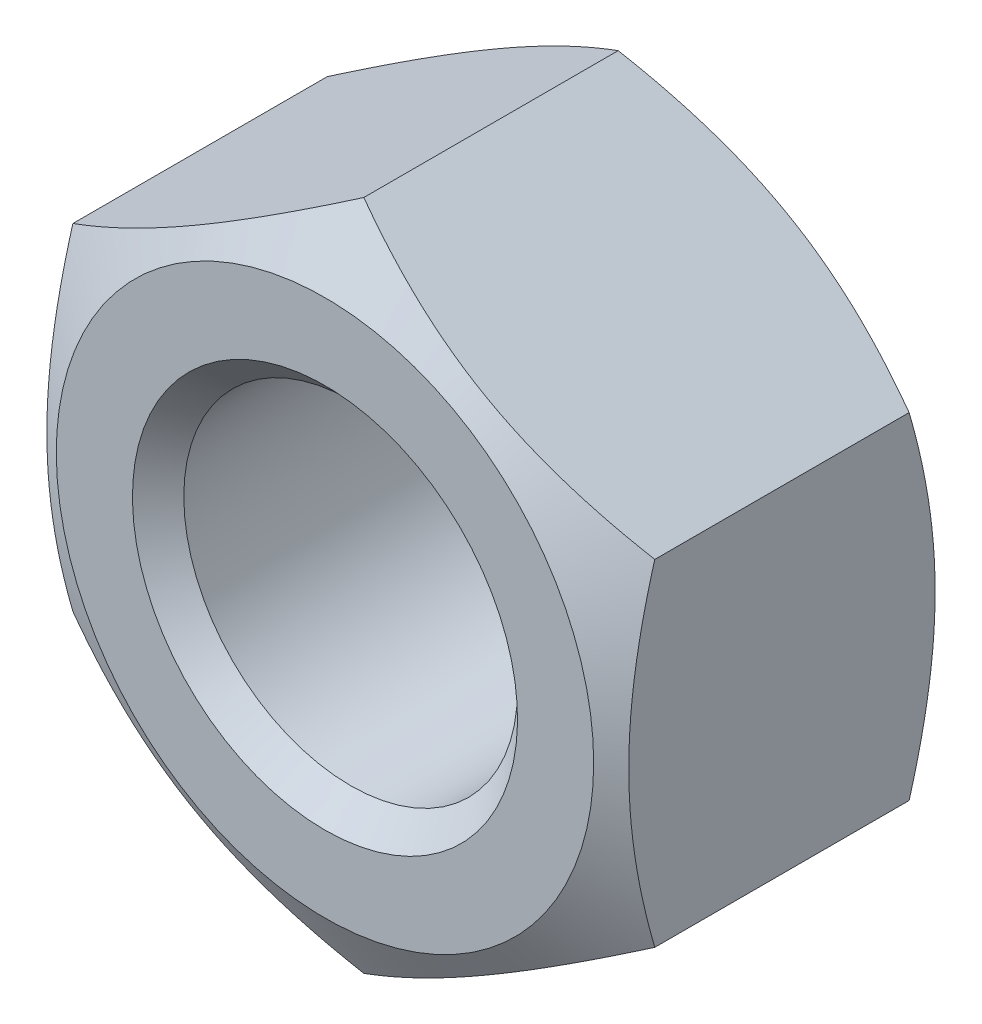
ISO-10303-21;
HEADER;
FILE_DESCRIPTION(('STEP AP214'),'2;1');
FILE_NAME('part.step','',(''),(''),'','','');
FILE_SCHEMA(('AUTOMOTIVE_DESIGN { 1 0 10303 214 1 1 1 1 }'));
ENDSEC;
DATA;
#1=APPLICATION_CONTEXT('core data for automotive mechanical design processes');
#2=APPLICATION_PROTOCOL_DEFINITION('international standard','automotive_design',2000,#1);
#3=PRODUCT_CONTEXT('',#1,'mechanical');
#4=PRODUCT('Part','Part','',(#3));
#5=PRODUCT_RELATED_PRODUCT_CATEGORY('part','',(#4));
#6=PRODUCT_DEFINITION_FORMATION('','',#4);
#7=PRODUCT_DEFINITION_CONTEXT('part definition',#1,'design');
#8=PRODUCT_DEFINITION('design','',#6,#7);
#9=PRODUCT_DEFINITION_SHAPE('','',#8);
#10=(LENGTH_UNIT() NAMED_UNIT(*) SI_UNIT(.MILLI.,.METRE.));
#11=(NAMED_UNIT(*) PLANE_ANGLE_UNIT() SI_UNIT($,.RADIAN.));
#12=(NAMED_UNIT(*) SI_UNIT($,.STERADIAN.) SOLID_ANGLE_UNIT());
#13=UNCERTAINTY_MEASURE_WITH_UNIT(LENGTH_MEASURE(1.E-05),#10,'distance_accuracy_value','');
#14=(GEOMETRIC_REPRESENTATION_CONTEXT(3) GLOBAL_UNCERTAINTY_ASSIGNED_CONTEXT((#13)) GLOBAL_UNIT_ASSIGNED_CONTEXT((#10,
#11,#12)) REPRESENTATION_CONTEXT('',''));
#15=CARTESIAN_POINT('',(0.,0.,0.));
#16=DIRECTION('',(0.,0.,1.));
#17=DIRECTION('',(1.,0.,0.));
#18=AXIS2_PLACEMENT_3D('',#15,#16,#17);
#19=CARTESIAN_POINT('',(0.,0.,0.));
#20=DIRECTION('',(0.,0.,1.));
#21=DIRECTION('',(1.,0.,0.));
#22=AXIS2_PLACEMENT_3D('',#19,#20,#21);
#23=PLANE('',#22);
#24=CARTESIAN_POINT('',(0.,0.,0.));
#25=DIRECTION('',(0.,0.,1.));
#26=DIRECTION('',(0.,-1.,0.));
#27=AXIS2_PLACEMENT_3D('',#24,#25,#26);
#28=CIRCLE('',#27,11.25);
#29=CARTESIAN_POINT('',(0.,-11.25,0.));
#30=VERTEX_POINT('',#29);
#31=EDGE_CURVE('E262',#30,#30,#28,.T.);
#32=ORIENTED_EDGE('',*,*,#31,.F.);
#33=EDGE_LOOP('',(#32));
#34=FACE_BOUND('',#33,.T.);
#35=CARTESIAN_POINT('',(0.,0.,0.));
#36=DIRECTION('',(0.,0.,1.));
#37=DIRECTION('',(1.,0.,0.));
#38=AXIS2_PLACEMENT_3D('',#35,#36,#37);
#39=CIRCLE('',#38,15.7);
#40=CARTESIAN_POINT('',(15.7,0.,0.));
#41=VERTEX_POINT('',#40);
#42=EDGE_CURVE('E221',#41,#41,#39,.T.);
#43=ORIENTED_EDGE('',*,*,#42,.T.);
#44=EDGE_LOOP('',(#43));
#45=FACE_BOUND('',#44,.T.);
#46=ADVANCED_FACE('F34',(#34,#45),#23,.T.);
#47=CARTESIAN_POINT('',(0.,0.,0.));
#48=DIRECTION('',(0.,0.,-1.));
#49=DIRECTION('',(-1.,0.,0.));
#50=AXIS2_PLACEMENT_3D('',#47,#48,#49);
#51=CONICAL_SURFACE('',#50,15.7,1.0471975511966);
#52=CARTESIAN_POINT('',(-17.0002,9.81483910616981,-2.26900077431108));
#53=CARTESIAN_POINT('',(-16.6265469064567,10.0305678203106,-2.14445819023212));
#54=CARTESIAN_POINT('',(-16.251436365233,10.2471379922619,-2.02556713985945));
#55=CARTESIAN_POINT('',(-15.4982073403609,10.6820149725333,-1.80065903466373));
#56=CARTESIAN_POINT('',(-15.1200879107272,10.9003223270181,-1.69464621406476));
#57=CARTESIAN_POINT('',(-14.3601103187305,11.3390955943355,-1.49691959430863));
#58=CARTESIAN_POINT('',(-13.9782455058022,11.5595653468737,-1.40523962826047));
#59=CARTESIAN_POINT('',(-13.2118624748498,12.0020367960964,-1.23814738869012));
#60=CARTESIAN_POINT('',(-12.8273444100892,12.2240384042942,-1.16273418351413));
#61=CARTESIAN_POINT('',(-12.0655075393886,12.6638851266718,-1.03138301007862));
#62=CARTESIAN_POINT('',(-11.6882452921721,12.8816975866573,-0.975010293167007));
#63=CARTESIAN_POINT('',(-10.9319921229911,13.3183205574595,-0.880485850052318));
#64=CARTESIAN_POINT('',(-10.5530011678939,13.5371310874053,-0.842334474574963));
#65=CARTESIAN_POINT('',(-9.79438261780434,13.9751197115118,-0.785216014403568));
#66=CARTESIAN_POINT('',(-9.41475631882947,14.1942970574164,-0.76622613300532));
#67=CARTESIAN_POINT('',(-8.65515330704035,14.6328540607501,-0.747839050498202));
#68=CARTESIAN_POINT('',(-8.27517660541659,14.8522337117183,-0.748441243980961));
#69=CARTESIAN_POINT('',(-7.56480067427073,15.2623694467912,-0.767870053870435));
#70=CARTESIAN_POINT('',(-7.23435083193736,15.4531547522161,-0.784327500506852));
#71=CARTESIAN_POINT('',(-6.57423939634649,15.8342702672496,-0.831747883297576));
#72=CARTESIAN_POINT('',(-6.2445777918682,16.0246004833366,-0.862710611714524));
#73=CARTESIAN_POINT('',(-5.58616773221974,16.4047337085118,-0.938604295800273));
#74=CARTESIAN_POINT('',(-5.25742037514752,16.5945360836128,-0.983547882986054));
#75=CARTESIAN_POINT('',(-4.60149064349035,16.9732372907546,-1.08661020340748));
#76=CARTESIAN_POINT('',(-4.27430826227985,17.1621361266206,-1.14472888081401));
#77=CARTESIAN_POINT('',(-3.281103910772,17.7355629263239,-1.34032568866998));
#78=CARTESIAN_POINT('',(-2.61795816688453,18.1184303000693,-1.4973073879878));
#79=CARTESIAN_POINT('',(-1.30155488695446,18.878456088099,-1.85359145296698));
#80=CARTESIAN_POINT('',(-0.648280497058976,19.2556242329599,-2.05281014623164));
#81=CARTESIAN_POINT('',(0.000200000000001784,19.6300246225011,-2.26900077431108));
#82=B_SPLINE_CURVE_WITH_KNOTS('',3,(#52,#53,#54,#55,#56,#57,#58,#59,#60,#61,#62,#63,#64,#65,#66,
#67,#68,#69,#70,#71,#72,#73,#74,#75,#76,#77,#78,#79,#80,#81),.UNSPECIFIED.,.F.,.F.,(4,2,2,2,2,2,
2,2,2,2,2,2,2,2,4),(0.,1.34725361023886,2.6949489909653,4.04577911356302,5.39653184888179,
6.71394507676439,8.03138366129191,9.34725301563479,10.6630817087628,11.808581597515,
12.9540650814946,14.1005865149997,15.2471030902392,17.590639246696,19.929575477219),.UNSPECIFIED.);
#83=CARTESIAN_POINT('',(-17.,9.81495457622365,-2.26893410705618));
#84=VERTEX_POINT('',#83);
#85=CARTESIAN_POINT('',(0.,19.6299091524473,-2.26893410705618));
#86=VERTEX_POINT('',#85);
#87=EDGE_CURVE('E216',#84,#86,#82,.T.);
#88=ORIENTED_EDGE('',*,*,#87,.F.);
#89=CARTESIAN_POINT('',(-17.,-25.9267472467528,-8.83528627186308));
#90=CARTESIAN_POINT('',(-17.,-25.5539648090977,-8.65530488119288));
#91=CARTESIAN_POINT('',(-17.,-25.1807288184547,-8.47626336943934));
#92=CARTESIAN_POINT('',(-17.,-24.4332538627016,-8.12027608125413));
#93=CARTESIAN_POINT('',(-17.,-24.0590148864408,-7.94333032824134));
#94=CARTESIAN_POINT('',(-17.,-22.9345384288083,-7.41590864060599));
#95=CARTESIAN_POINT('',(-17.,-22.1826644417827,-7.06890784699101));
#96=CARTESIAN_POINT('',(-17.,-20.6693295294818,-6.38442672467381));
#97=CARTESIAN_POINT('',(-17.,-19.9078382964153,-6.04701323457675));
#98=CARTESIAN_POINT('',(-17.,-18.3785592608469,-5.38682372702414));
#99=CARTESIAN_POINT('',(-17.,-17.6107717926793,-5.06404693821717));
#100=CARTESIAN_POINT('',(-17.,-16.0586340457663,-4.43340326623387));
#101=CARTESIAN_POINT('',(-17.,-15.274195004503,-4.12575369084784));
#102=CARTESIAN_POINT('',(-17.,-13.696022043621,-3.53480920182964));
#103=CARTESIAN_POINT('',(-17.,-12.9022870972841,-3.25151700781198));
#104=CARTESIAN_POINT('',(-17.,-11.3059512165511,-2.71697899718527));
#105=CARTESIAN_POINT('',(-17.,-10.5033735966652,-2.46566413029521));
#106=CARTESIAN_POINT('',(-17.,-8.88673603066168,-2.00329800631384));
#107=CARTESIAN_POINT('',(-17.,-8.07267983149313,-1.79223392262732));
#108=CARTESIAN_POINT('',(-17.,-6.84282468382309,-1.51359777047095));
#109=CARTESIAN_POINT('',(-17.,-6.43130091987701,-1.42702780561636));
#110=CARTESIAN_POINT('',(-17.,-5.60553570443179,-1.26792169073959));
#111=CARTESIAN_POINT('',(-17.,-5.19129431536871,-1.19538521946428));
#112=CARTESIAN_POINT('',(-17.,-4.36037948024351,-1.06563790696937));
#113=CARTESIAN_POINT('',(-17.,-3.94370588240015,-1.00842803287828));
#114=CARTESIAN_POINT('',(-17.,-3.10841242547604,-0.910486373547461));
#115=CARTESIAN_POINT('',(-17.,-2.68979256380067,-0.869754610281469));
#116=CARTESIAN_POINT('',(-17.,-1.85381375994843,-0.805860178374631));
#117=CARTESIAN_POINT('',(-17.,-1.43646307035987,-0.782590240303972));
#118=CARTESIAN_POINT('',(-17.,-0.601153044712188,-0.753740168759731));
#119=CARTESIAN_POINT('',(-17.,-0.183193717826098,-0.748159771384462));
#120=CARTESIAN_POINT('',(-17.,0.652471507108319,-0.754820619047691));
#121=CARTESIAN_POINT('',(-17.,1.070177443126,-0.767057044362938));
#122=CARTESIAN_POINT('',(-17.,1.90470927270493,-0.809050414750458));
#123=CARTESIAN_POINT('',(-17.,2.32153512661024,-0.838808133097964));
#124=CARTESIAN_POINT('',(-17.,3.33484820370525,-0.931831324455307));
#125=CARTESIAN_POINT('',(-17.,3.93052966291356,-1.00404527837153));
#126=CARTESIAN_POINT('',(-17.,5.11715583192569,-1.18021128874136));
#127=CARTESIAN_POINT('',(-17.,5.7080998115513,-1.28416814469026));
#128=CARTESIAN_POINT('',(-17.,7.47489110533387,-1.63843047027764));
#129=CARTESIAN_POINT('',(-17.,8.64238042158542,-1.9308880733226));
#130=CARTESIAN_POINT('',(-17.,10.3885450516742,-2.43429179450095));
#131=CARTESIAN_POINT('',(-17.,10.9763653928662,-2.61530716784065));
#132=CARTESIAN_POINT('',(-17.,12.1463268837286,-2.99516492515156));
#133=CARTESIAN_POINT('',(-17.,12.7284675203987,-3.19400890320246));
#134=CARTESIAN_POINT('',(-17.,13.8841642605752,-3.60530371093944));
#135=CARTESIAN_POINT('',(-17.,14.4577503102576,-3.81767110050551));
#136=CARTESIAN_POINT('',(-17.,15.3145292969767,-4.14530846477523));
#137=CARTESIAN_POINT('',(-17.,15.5994765967891,-4.25601670616324));
#138=CARTESIAN_POINT('',(-17.,16.1682685205824,-4.48021558039378));
#139=CARTESIAN_POINT('',(-17.,16.4521131659655,-4.59370615891639));
#140=CARTESIAN_POINT('',(-17.,16.735444987615,-4.70846199828913));
#141=B_SPLINE_CURVE_WITH_KNOTS('',3,(#89,#90,#91,#92,#93,#94,#95,#96,#97,#98,#99,#100,#101,#102,
#103,#104,#105,#106,#107,#108,#109,#110,#111,#112,#113,#114,#115,#116,#117,#118,#119,#120,#121,
#122,#123,#124,#125,#126,#127,#128,#129,#130,#131,#132,#133,#134,#135,#136,#137,#138,#139,#140),
.UNSPECIFIED.,.F.,.F.,(4,2,2,2,2,2,2,2,2,2,2,2,2,2,2,2,2,2,2,2,2,2,2,2,2,4),(0.,
1.24186727211345,2.48374840829803,4.96792071543007,7.46649146485291,9.96493038667426,
12.4924537659258,15.0202589893835,17.5425096574214,20.0639552194549,21.3253468534078,
22.5867096083098,23.8481519381283,25.1095959500881,26.3632259008802,27.6168371492864,
28.8701093396594,30.1234368454131,31.9225406006737,33.721916513448,37.3276264552829,
39.1726660852152,41.0178708474609,42.8526253217389,43.7697066959693,44.6867701801409),.UNSPECIFIED.);
#142=CARTESIAN_POINT('',(-17.,-9.81495457622364,-2.26893410705618));
#143=VERTEX_POINT('',#142);
#144=EDGE_CURVE('E184',#143,#84,#141,.T.);
#145=ORIENTED_EDGE('',*,*,#144,.F.);
#146=CARTESIAN_POINT('',(0.000199999999992894,-19.6300246225011,-2.26900077431108));
#147=CARTESIAN_POINT('',(-0.373453093543291,-19.4142959083604,-2.14445819023212));
#148=CARTESIAN_POINT('',(-0.748563634767014,-19.197725736409,-2.02556713985945));
#149=CARTESIAN_POINT('',(-1.50179265963909,-18.7628487561377,-1.80065903466373));
#150=CARTESIAN_POINT('',(-1.87991208927283,-18.5445414016528,-1.69464621406476));
#151=CARTESIAN_POINT('',(-2.63988968126951,-18.1057681343354,-1.49691959430863));
#152=CARTESIAN_POINT('',(-3.02175449419786,-17.8852983817972,-1.40523962826047));
#153=CARTESIAN_POINT('',(-3.78813752515018,-17.4428269325745,-1.23814738869012));
#154=CARTESIAN_POINT('',(-4.1726555899108,-17.2208253243767,-1.16273418351413));
#155=CARTESIAN_POINT('',(-4.93449246061139,-16.7809786019991,-1.03138301007862));
#156=CARTESIAN_POINT('',(-5.31175470782787,-16.5631661420136,-0.975010293167006));
#157=CARTESIAN_POINT('',(-6.06800787700895,-16.1265431712114,-0.880485850052319));
#158=CARTESIAN_POINT('',(-6.44699883210612,-15.9077326412656,-0.842334474574963));
#159=CARTESIAN_POINT('',(-7.20561738219567,-15.4697440171592,-0.785216014403568));
#160=CARTESIAN_POINT('',(-7.58524368117054,-15.2505666712546,-0.766226133005319));
#161=CARTESIAN_POINT('',(-8.34484669295967,-14.8120096679209,-0.747839050498201));
#162=CARTESIAN_POINT('',(-8.72482339458342,-14.5926300169526,-0.748441243980961));
#163=CARTESIAN_POINT('',(-9.43519932572928,-14.1824942818797,-0.767870053870435));
#164=CARTESIAN_POINT('',(-9.76564916806265,-13.9917089764549,-0.784327500506851));
#165=CARTESIAN_POINT('',(-10.4257606036535,-13.6105934614213,-0.831747883297576));
#166=CARTESIAN_POINT('',(-10.7554222081318,-13.4202632453343,-0.862710611714525));
#167=CARTESIAN_POINT('',(-11.4138322677803,-13.0401300201591,-0.938604295800274));
#168=CARTESIAN_POINT('',(-11.7425796248525,-12.8503276450581,-0.983547882986055));
#169=CARTESIAN_POINT('',(-12.3985093565097,-12.4716264379163,-1.08661020340748));
#170=CARTESIAN_POINT('',(-12.7256917377202,-12.2827276020504,-1.14472888081401));
#171=CARTESIAN_POINT('',(-13.718896089228,-11.709300802347,-1.34032568866998));
#172=CARTESIAN_POINT('',(-14.3820418331155,-11.3264334286016,-1.4973073879878));
#173=CARTESIAN_POINT('',(-15.6984451130455,-10.5664076405719,-1.85359145296698));
#174=CARTESIAN_POINT('',(-16.351719502941,-10.189239495711,-2.05281014623164));
#175=CARTESIAN_POINT('',(-17.0002,-9.8148391061698,-2.26900077431108));
#176=B_SPLINE_CURVE_WITH_KNOTS('',3,(#146,#147,#148,#149,#150,#151,#152,#153,#154,#155,#156,
#157,#158,#159,#160,#161,#162,#163,#164,#165,#166,#167,#168,#169,#170,#171,#172,#173,#174,#175),
.UNSPECIFIED.,.F.,.F.,(4,2,2,2,2,2,2,2,2,2,2,2,2,2,4),(0.,1.34725361023886,2.6949489909653,
4.04577911356303,5.39653184888179,6.71394507676439,8.0313836612919,9.34725301563479,
10.6630817087628,11.808581597515,12.9540650814946,14.1005865149997,15.2471030902392,
17.590639246696,19.929575477219),.UNSPECIFIED.);
#177=CARTESIAN_POINT('',(0.,-19.6299091524473,-2.26893410705618));
#178=VERTEX_POINT('',#177);
#179=EDGE_CURVE('E176',#178,#143,#176,.T.);
#180=ORIENTED_EDGE('',*,*,#179,.F.);
#181=CARTESIAN_POINT('',(17.0002,-9.81483910616981,-2.26900077431107));
#182=CARTESIAN_POINT('',(16.6265469064567,-10.0305678203106,-2.14445819023211));
#183=CARTESIAN_POINT('',(16.251436365233,-10.2471379922619,-2.02556713985945));
#184=CARTESIAN_POINT('',(15.4982073403609,-10.6820149725333,-1.80065903466373));
#185=CARTESIAN_POINT('',(15.1200879107272,-10.9003223270181,-1.69464621406476));
#186=CARTESIAN_POINT('',(14.3601103187305,-11.3390955943355,-1.49691959430862));
#187=CARTESIAN_POINT('',(13.9782455058021,-11.5595653468737,-1.40523962826047));
#188=CARTESIAN_POINT('',(13.2118624748498,-12.0020367960964,-1.23814738869011));
#189=CARTESIAN_POINT('',(12.8273444100892,-12.2240384042942,-1.16273418351412));
#190=CARTESIAN_POINT('',(12.0655075393886,-12.6638851266718,-1.03138301007861));
#191=CARTESIAN_POINT('',(11.6882452921721,-12.8816975866573,-0.975010293167003));
#192=CARTESIAN_POINT('',(10.931992122991,-13.3183205574595,-0.880485850052316));
#193=CARTESIAN_POINT('',(10.5530011678939,-13.5371310874053,-0.84233447457496));
#194=CARTESIAN_POINT('',(9.79438261780433,-13.9751197115118,-0.785216014403565));
#195=CARTESIAN_POINT('',(9.41475631882946,-14.1942970574164,-0.766226133005318));
#196=CARTESIAN_POINT('',(8.65515330704033,-14.6328540607501,-0.747839050498201));
#197=CARTESIAN_POINT('',(8.27517660541658,-14.8522337117183,-0.748441243980961));
#198=CARTESIAN_POINT('',(7.56480067427072,-15.2623694467912,-0.767870053870435));
#199=CARTESIAN_POINT('',(7.23435083193735,-15.4531547522161,-0.784327500506851));
#200=CARTESIAN_POINT('',(6.57423939634648,-15.8342702672496,-0.831747883297575));
#201=CARTESIAN_POINT('',(6.2445777918682,-16.0246004833366,-0.862710611714522));
#202=CARTESIAN_POINT('',(5.58616773221973,-16.4047337085118,-0.938604295800271));
#203=CARTESIAN_POINT('',(5.25742037514752,-16.5945360836128,-0.983547882986052));
#204=CARTESIAN_POINT('',(4.60149064349034,-16.9732372907546,-1.08661020340748));
#205=CARTESIAN_POINT('',(4.27430826227984,-17.1621361266206,-1.14472888081401));
#206=CARTESIAN_POINT('',(3.28110391077199,-17.7355629263239,-1.34032568866998));
#207=CARTESIAN_POINT('',(2.61795816688453,-18.1184303000693,-1.4973073879878));
#208=CARTESIAN_POINT('',(1.30155488695446,-18.878456088099,-1.85359145296698));
#209=CARTESIAN_POINT('',(0.648280497058971,-19.2556242329599,-2.05281014623164));
#210=CARTESIAN_POINT('',(-0.000200000000007482,-19.6300246225011,-2.26900077431108));
#211=B_SPLINE_CURVE_WITH_KNOTS('',3,(#181,#182,#183,#184,#185,#186,#187,#188,#189,#190,#191,
#192,#193,#194,#195,#196,#197,#198,#199,#200,#201,#202,#203,#204,#205,#206,#207,#208,#209,#210),
.UNSPECIFIED.,.F.,.F.,(4,2,2,2,2,2,2,2,2,2,2,2,2,2,4),(0.,1.34725361023886,2.6949489909653,
4.04577911356302,5.39653184888179,6.71394507676438,8.0313836612919,9.34725301563479,
10.6630817087628,11.808581597515,12.9540650814946,14.1005865149997,15.2471030902392,
17.590639246696,19.929575477219),.UNSPECIFIED.);
#212=CARTESIAN_POINT('',(17.,-9.81495457622364,-2.26893410705618));
#213=VERTEX_POINT('',#212);
#214=EDGE_CURVE('E92',#213,#178,#211,.T.);
#215=ORIENTED_EDGE('',*,*,#214,.F.);
#216=CARTESIAN_POINT('',(17.,-25.9267472467528,-8.83528627186308));
#217=CARTESIAN_POINT('',(17.,-25.5539648090977,-8.65530488119288));
#218=CARTESIAN_POINT('',(17.,-25.1807288184547,-8.47626336943934));
#219=CARTESIAN_POINT('',(17.,-24.4332538627016,-8.12027608125413));
#220=CARTESIAN_POINT('',(17.,-24.0590148864408,-7.94333032824134));
#221=CARTESIAN_POINT('',(17.,-22.9345384288083,-7.41590864060598));
#222=CARTESIAN_POINT('',(17.,-22.1826644417827,-7.06890784699101));
#223=CARTESIAN_POINT('',(17.,-20.6693295294818,-6.38442672467381));
#224=CARTESIAN_POINT('',(17.,-19.9078382964153,-6.04701323457675));
#225=CARTESIAN_POINT('',(17.,-18.3785592608469,-5.38682372702413));
#226=CARTESIAN_POINT('',(17.,-17.6107717926793,-5.06404693821717));
#227=CARTESIAN_POINT('',(17.,-16.0586340457663,-4.43340326623387));
#228=CARTESIAN_POINT('',(17.,-15.274195004503,-4.12575369084784));
#229=CARTESIAN_POINT('',(17.,-13.696022043621,-3.53480920182964));
#230=CARTESIAN_POINT('',(17.,-12.9022870972841,-3.25151700781198));
#231=CARTESIAN_POINT('',(17.,-11.3059512165511,-2.71697899718527));
#232=CARTESIAN_POINT('',(17.,-10.5033735966652,-2.4656641302952));
#233=CARTESIAN_POINT('',(17.,-8.88673603066168,-2.00329800631384));
#234=CARTESIAN_POINT('',(17.,-8.07267983149313,-1.79223392262732));
#235=CARTESIAN_POINT('',(17.,-6.84282468382309,-1.51359777047094));
#236=CARTESIAN_POINT('',(17.,-6.43130091987702,-1.42702780561635));
#237=CARTESIAN_POINT('',(17.,-5.6055357044318,-1.26792169073958));
#238=CARTESIAN_POINT('',(17.,-5.19129431536872,-1.19538521946427));
#239=CARTESIAN_POINT('',(17.,-4.36037948024352,-1.06563790696937));
#240=CARTESIAN_POINT('',(17.,-3.94370588240016,-1.00842803287828));
#241=CARTESIAN_POINT('',(17.,-3.10841242547605,-0.910486373547459));
#242=CARTESIAN_POINT('',(17.,-2.68979256380068,-0.869754610281466));
#243=CARTESIAN_POINT('',(17.,-1.85381375994844,-0.805860178374626));
#244=CARTESIAN_POINT('',(17.,-1.43646307035988,-0.782590240303966));
#245=CARTESIAN_POINT('',(17.,-0.601153044712196,-0.753740168759725));
#246=CARTESIAN_POINT('',(17.,-0.183193717826106,-0.748159771384455));
#247=CARTESIAN_POINT('',(17.,0.65247150710831,-0.754820619047686));
#248=CARTESIAN_POINT('',(17.,1.07017744312599,-0.767057044362933));
#249=CARTESIAN_POINT('',(17.,1.90470927270492,-0.809050414750454));
#250=CARTESIAN_POINT('',(17.,2.32153512661023,-0.838808133097959));
#251=CARTESIAN_POINT('',(17.,3.33484820370524,-0.9318313244553));
#252=CARTESIAN_POINT('',(17.,3.93052966291355,-1.00404527837152));
#253=CARTESIAN_POINT('',(17.,5.11715583192568,-1.18021128874135));
#254=CARTESIAN_POINT('',(17.,5.70809981155129,-1.28416814469026));
#255=CARTESIAN_POINT('',(17.,7.47489110533385,-1.63843047027763));
#256=CARTESIAN_POINT('',(17.,8.6423804215854,-1.93088807332259));
#257=CARTESIAN_POINT('',(17.,10.3885450516742,-2.43429179450094));
#258=CARTESIAN_POINT('',(17.,10.9763653928662,-2.61530716784064));
#259=CARTESIAN_POINT('',(17.,12.1463268837285,-2.99516492515155));
#260=CARTESIAN_POINT('',(17.,12.7284675203987,-3.19400890320245));
#261=CARTESIAN_POINT('',(17.,13.8841642605752,-3.60530371093943));
#262=CARTESIAN_POINT('',(17.,14.4577503102576,-3.8176711005055));
#263=CARTESIAN_POINT('',(17.,15.3145292969767,-4.14530846477522));
#264=CARTESIAN_POINT('',(17.,15.5994765967891,-4.25601670616323));
#265=CARTESIAN_POINT('',(17.,16.1682685205824,-4.48021558039377));
#266=CARTESIAN_POINT('',(17.,16.4521131659654,-4.59370615891638));
#267=CARTESIAN_POINT('',(17.,16.735444987615,-4.70846199828912));
#268=B_SPLINE_CURVE_WITH_KNOTS('',3,(#216,#217,#218,#219,#220,#221,#222,#223,#224,#225,#226,
#227,#228,#229,#230,#231,#232,#233,#234,#235,#236,#237,#238,#239,#240,#241,#242,#243,#244,#245,
#246,#247,#248,#249,#250,#251,#252,#253,#254,#255,#256,#257,#258,#259,#260,#261,#262,#263,#264,
#265,#266,#267),.UNSPECIFIED.,.F.,.F.,(4,2,2,2,2,2,2,2,2,2,2,2,2,2,2,2,2,2,2,2,2,2,2,2,2,4),(0.,
1.24186727211345,2.48374840829802,4.96792071543007,7.4664914648529,9.96493038667426,
12.4924537659258,15.0202589893835,17.5425096574214,20.0639552194549,21.3253468534078,
22.5867096083098,23.8481519381283,25.1095959500881,26.3632259008801,27.6168371492863,
28.8701093396594,30.123436845413,31.9225406006737,33.721916513448,37.3276264552828,
39.1726660852152,41.0178708474609,42.8526253217388,43.7697066959693,44.6867701801409),.UNSPECIFIED.);
#269=CARTESIAN_POINT('',(17.,9.81495457622366,-2.26893410705618));
#270=VERTEX_POINT('',#269);
#271=EDGE_CURVE('E88',#270,#213,#268,.F.);
#272=ORIENTED_EDGE('',*,*,#271,.F.);
#273=CARTESIAN_POINT('',(-0.00019999999999798,19.6300246225011,-2.26900077431108));
#274=CARTESIAN_POINT('',(0.373453093543288,19.4142959083604,-2.14445819023211));
#275=CARTESIAN_POINT('',(0.748563634767011,19.197725736409,-2.02556713985945));
#276=CARTESIAN_POINT('',(1.50179265963908,18.7628487561377,-1.80065903466373));
#277=CARTESIAN_POINT('',(1.87991208927282,18.5445414016528,-1.69464621406476));
#278=CARTESIAN_POINT('',(2.63988968126951,18.1057681343354,-1.49691959430863));
#279=CARTESIAN_POINT('',(3.02175449419785,17.8852983817972,-1.40523962826047));
#280=CARTESIAN_POINT('',(3.78813752515018,17.4428269325745,-1.23814738869011));
#281=CARTESIAN_POINT('',(4.1726555899108,17.2208253243767,-1.16273418351413));
#282=CARTESIAN_POINT('',(4.93449246061139,16.7809786019991,-1.03138301007862));
#283=CARTESIAN_POINT('',(5.31175470782786,16.5631661420136,-0.975010293167004));
#284=CARTESIAN_POINT('',(6.06800787700895,16.1265431712114,-0.880485850052316));
#285=CARTESIAN_POINT('',(6.44699883210612,15.9077326412656,-0.842334474574962));
#286=CARTESIAN_POINT('',(7.20561738219567,15.4697440171592,-0.785216014403569));
#287=CARTESIAN_POINT('',(7.58524368117054,15.2505666712546,-0.76622613300532));
#288=CARTESIAN_POINT('',(8.34484669295966,14.8120096679209,-0.747839050498202));
#289=CARTESIAN_POINT('',(8.72482339458342,14.5926300169526,-0.748441243980961));
#290=CARTESIAN_POINT('',(9.43519932572927,14.1824942818797,-0.767870053870435));
#291=CARTESIAN_POINT('',(9.76564916806265,13.9917089764549,-0.784327500506851));
#292=CARTESIAN_POINT('',(10.4257606036535,13.6105934614213,-0.831747883297575));
#293=CARTESIAN_POINT('',(10.7554222081318,13.4202632453343,-0.862710611714522));
#294=CARTESIAN_POINT('',(11.4138322677803,13.0401300201591,-0.938604295800271));
#295=CARTESIAN_POINT('',(11.7425796248525,12.8503276450581,-0.983547882986052));
#296=CARTESIAN_POINT('',(12.3985093565096,12.4716264379163,-1.08661020340748));
#297=CARTESIAN_POINT('',(12.7256917377201,12.2827276020504,-1.14472888081401));
#298=CARTESIAN_POINT('',(13.718896089228,11.709300802347,-1.34032568866998));
#299=CARTESIAN_POINT('',(14.3820418331155,11.3264334286016,-1.49730738798779));
#300=CARTESIAN_POINT('',(15.6984451130455,10.5664076405719,-1.85359145296697));
#301=CARTESIAN_POINT('',(16.351719502941,10.189239495711,-2.05281014623164));
#302=CARTESIAN_POINT('',(17.0002,9.81483910616981,-2.26900077431108));
#303=B_SPLINE_CURVE_WITH_KNOTS('',3,(#273,#274,#275,#276,#277,#278,#279,#280,#281,#282,#283,
#284,#285,#286,#287,#288,#289,#290,#291,#292,#293,#294,#295,#296,#297,#298,#299,#300,#301,#302),
.UNSPECIFIED.,.F.,.F.,(4,2,2,2,2,2,2,2,2,2,2,2,2,2,4),(0.,1.34725361023886,2.6949489909653,
4.04577911356303,5.39653184888179,6.71394507676439,8.0313836612919,9.34725301563479,
10.6630817087628,11.808581597515,12.9540650814946,14.1005865149997,15.2471030902392,
17.590639246696,19.929575477219),.UNSPECIFIED.);
#304=EDGE_CURVE('E60',#86,#270,#303,.T.);
#305=ORIENTED_EDGE('',*,*,#304,.F.);
#306=EDGE_LOOP('',(#88,#145,#180,#215,#272,#305));
#307=FACE_BOUND('',#306,.T.);
#308=ORIENTED_EDGE('',*,*,#42,.F.);
#309=EDGE_LOOP('',(#308));
#310=FACE_BOUND('',#309,.T.);
#311=ADVANCED_FACE('F89',(#307,#310),#51,.T.);
#312=CARTESIAN_POINT('',(17.,9.81495457622365,-19.4));
#313=DIRECTION('',(0.5,0.866025403784439,0.));
#314=DIRECTION('',(-0.866025403784439,0.5,0.));
#315=AXIS2_PLACEMENT_3D('',#312,#313,#314);
#316=PLANE('',#315);
#317=DIRECTION('',(0.,0.,1.));
#318=VECTOR('',#317,1.);
#319=CARTESIAN_POINT('',(17.,9.81495457622365,-19.4));
#320=LINE('',#319,#318);
#321=CARTESIAN_POINT('',(17.,9.81495457622366,-17.1310658929438));
#322=VERTEX_POINT('',#321);
#323=EDGE_CURVE('E11',#322,#270,#320,.T.);
#324=ORIENTED_EDGE('',*,*,#323,.F.);
#325=CARTESIAN_POINT('',(17.0002,9.81483910616981,-17.1309992256889));
#326=CARTESIAN_POINT('',(16.6265469064567,10.0305678203106,-17.2555418097679));
#327=CARTESIAN_POINT('',(16.251436365233,10.2471379922619,-17.3744328601406));
#328=CARTESIAN_POINT('',(15.4982073403609,10.6820149725333,-17.5993409653363));
#329=CARTESIAN_POINT('',(15.1200879107272,10.9003223270181,-17.7053537859352));
#330=CARTESIAN_POINT('',(14.3601103187305,11.3390955943355,-17.9030804056914));
#331=CARTESIAN_POINT('',(13.9782455058021,11.5595653468737,-17.9947603717395));
#332=CARTESIAN_POINT('',(13.2118624748498,12.0020367960964,-18.1618526113099));
#333=CARTESIAN_POINT('',(12.8273444100892,12.2240384042942,-18.2372658164859));
#334=CARTESIAN_POINT('',(12.0655075393886,12.6638851266718,-18.3686169899214));
#335=CARTESIAN_POINT('',(11.6882452921721,12.8816975866573,-18.424989706833));
#336=CARTESIAN_POINT('',(10.931992122991,13.3183205574595,-18.5195141499477));
#337=CARTESIAN_POINT('',(10.5530011678939,13.5371310874053,-18.557665525425));
#338=CARTESIAN_POINT('',(9.79438261780433,13.9751197115118,-18.6147839855964));
#339=CARTESIAN_POINT('',(9.41475631882946,14.1942970574164,-18.6337738669947));
#340=CARTESIAN_POINT('',(8.65515330704034,14.6328540607501,-18.6521609495018));
#341=CARTESIAN_POINT('',(8.27517660541658,14.8522337117183,-18.651558756019));
#342=CARTESIAN_POINT('',(7.56480067427072,15.2623694467912,-18.6321299461296));
#343=CARTESIAN_POINT('',(7.23435083193735,15.4531547522161,-18.6156724994931));
#344=CARTESIAN_POINT('',(6.57423939634648,15.8342702672496,-18.5682521167024));
#345=CARTESIAN_POINT('',(6.2445777918682,16.0246004833366,-18.5372893882855));
#346=CARTESIAN_POINT('',(5.58616773221973,16.4047337085118,-18.4613957041997));
#347=CARTESIAN_POINT('',(5.25742037514752,16.5945360836128,-18.4164521170139));
#348=CARTESIAN_POINT('',(4.60149064349035,16.9732372907546,-18.3133897965925));
#349=CARTESIAN_POINT('',(4.27430826227985,17.1621361266206,-18.255271119186));
#350=CARTESIAN_POINT('',(3.281103910772,17.7355629263239,-18.05967431133));
#351=CARTESIAN_POINT('',(2.61795816688453,18.1184303000693,-17.9026926120122));
#352=CARTESIAN_POINT('',(1.30155488695446,18.878456088099,-17.546408547033));
#353=CARTESIAN_POINT('',(0.648280497058978,19.2556242329599,-17.3471898537684));
#354=CARTESIAN_POINT('',(-0.000199999999998876,19.6300246225011,-17.1309992256889));
#355=B_SPLINE_CURVE_WITH_KNOTS('',3,(#325,#326,#327,#328,#329,#330,#331,#332,#333,#334,#335,
#336,#337,#338,#339,#340,#341,#342,#343,#344,#345,#346,#347,#348,#349,#350,#351,#352,#353,#354),
.UNSPECIFIED.,.F.,.F.,(4,2,2,2,2,2,2,2,2,2,2,2,2,2,4),(0.,1.34725361023886,2.6949489909653,
4.04577911356302,5.39653184888179,6.71394507676438,8.0313836612919,9.34725301563478,
10.6630817087628,11.808581597515,12.9540650814946,14.1005865149997,15.2471030902392,
17.590639246696,19.929575477219),.UNSPECIFIED.);
#356=CARTESIAN_POINT('',(0.,19.6299091524473,-17.1310658929438));
#357=VERTEX_POINT('',#356);
#358=EDGE_CURVE('E108',#322,#357,#355,.T.);
#359=ORIENTED_EDGE('',*,*,#358,.T.);
#360=DIRECTION('',(0.,0.,1.));
#361=VECTOR('',#360,1.);
#362=CARTESIAN_POINT('',(0.,19.6299091524473,-19.4));
#363=LINE('',#362,#361);
#364=EDGE_CURVE('E39',#357,#86,#363,.T.);
#365=ORIENTED_EDGE('',*,*,#364,.T.);
#366=ORIENTED_EDGE('',*,*,#304,.T.);
#367=EDGE_LOOP('',(#324,#359,#365,#366));
#368=FACE_BOUND('',#367,.T.);
#369=ADVANCED_FACE('F36',(#368),#316,.T.);
#370=CARTESIAN_POINT('',(17.,-9.81495457622365,-19.4));
#371=DIRECTION('',(1.,0.,0.));
#372=DIRECTION('',(0.,0.,-1.));
#373=AXIS2_PLACEMENT_3D('',#370,#371,#372);
#374=PLANE('',#373);
#375=DIRECTION('',(0.,0.,1.));
#376=VECTOR('',#375,1.);
#377=CARTESIAN_POINT('',(17.,-9.81495457622365,-19.4));
#378=LINE('',#377,#376);
#379=CARTESIAN_POINT('',(17.,-9.81495457622364,-17.1310658929438));
#380=VERTEX_POINT('',#379);
#381=EDGE_CURVE('E44',#380,#213,#378,.T.);
#382=ORIENTED_EDGE('',*,*,#381,.F.);
#383=CARTESIAN_POINT('',(17.,-25.9267472467528,-10.5647137281369));
#384=CARTESIAN_POINT('',(17.,-25.5539648090977,-10.7446951188071));
#385=CARTESIAN_POINT('',(17.,-25.1807288184547,-10.9237366305607));
#386=CARTESIAN_POINT('',(17.,-24.4332538627016,-11.2797239187459));
#387=CARTESIAN_POINT('',(17.,-24.0590148864408,-11.4566696717587));
#388=CARTESIAN_POINT('',(17.,-22.9345384288083,-11.984091359394));
#389=CARTESIAN_POINT('',(17.,-22.1826644417827,-12.331092153009));
#390=CARTESIAN_POINT('',(17.,-20.6693295294818,-13.0155732753262));
#391=CARTESIAN_POINT('',(17.,-19.9078382964153,-13.3529867654232));
#392=CARTESIAN_POINT('',(17.,-18.3785592608469,-14.0131762729759));
#393=CARTESIAN_POINT('',(17.,-17.6107717926793,-14.3359530617828));
#394=CARTESIAN_POINT('',(17.,-16.0586340457663,-14.9665967337661));
#395=CARTESIAN_POINT('',(17.,-15.274195004503,-15.2742463091522));
#396=CARTESIAN_POINT('',(17.,-13.696022043621,-15.8651907981704));
#397=CARTESIAN_POINT('',(17.,-12.9022870972841,-16.148482992188));
#398=CARTESIAN_POINT('',(17.,-11.3059512165511,-16.6830210028147));
#399=CARTESIAN_POINT('',(17.,-10.5033735966652,-16.9343358697048));
#400=CARTESIAN_POINT('',(17.,-8.88673603066168,-17.3967019936862));
#401=CARTESIAN_POINT('',(17.,-8.07267983149313,-17.6077660773727));
#402=CARTESIAN_POINT('',(17.,-6.84282468382309,-17.8864022295291));
#403=CARTESIAN_POINT('',(17.,-6.43130091987702,-17.9729721943836));
#404=CARTESIAN_POINT('',(17.,-5.6055357044318,-18.1320783092604));
#405=CARTESIAN_POINT('',(17.,-5.19129431536872,-18.2046147805357));
#406=CARTESIAN_POINT('',(17.,-4.36037948024351,-18.3343620930306));
#407=CARTESIAN_POINT('',(17.,-3.94370588240016,-18.3915719671217));
#408=CARTESIAN_POINT('',(17.,-3.10841242547604,-18.4895136264525));
#409=CARTESIAN_POINT('',(17.,-2.68979256380068,-18.5302453897185));
#410=CARTESIAN_POINT('',(17.,-1.85381375994844,-18.5941398216254));
#411=CARTESIAN_POINT('',(17.,-1.43646307035988,-18.617409759696));
#412=CARTESIAN_POINT('',(17.,-0.601153044712196,-18.6462598312403));
#413=CARTESIAN_POINT('',(17.,-0.183193717826106,-18.6518402286155));
#414=CARTESIAN_POINT('',(17.,0.65247150710831,-18.6451793809523));
#415=CARTESIAN_POINT('',(17.,1.07017744312599,-18.6329429556371));
#416=CARTESIAN_POINT('',(17.,1.90470927270493,-18.5909495852495));
#417=CARTESIAN_POINT('',(17.,2.32153512661023,-18.561191866902));
#418=CARTESIAN_POINT('',(17.,3.33484820370524,-18.4681686755447));
#419=CARTESIAN_POINT('',(17.,3.93052966291355,-18.3959547216285));
#420=CARTESIAN_POINT('',(17.,5.11715583192568,-18.2197887112586));
#421=CARTESIAN_POINT('',(17.,5.70809981155128,-18.1158318553097));
#422=CARTESIAN_POINT('',(17.,7.47489110533385,-17.7615695297224));
#423=CARTESIAN_POINT('',(17.,8.64238042158541,-17.4691119266774));
#424=CARTESIAN_POINT('',(17.,10.3885450516742,-16.9657082054991));
#425=CARTESIAN_POINT('',(17.,10.9763653928662,-16.7846928321594));
#426=CARTESIAN_POINT('',(17.,12.1463268837285,-16.4048350748484));
#427=CARTESIAN_POINT('',(17.,12.7284675203987,-16.2059910967975));
#428=CARTESIAN_POINT('',(17.,13.8841642605752,-15.7946962890606));
#429=CARTESIAN_POINT('',(17.,14.4577503102576,-15.5823288994945));
#430=CARTESIAN_POINT('',(17.,15.3145292969767,-15.2546915352248));
#431=CARTESIAN_POINT('',(17.,15.5994765967891,-15.1439832938368));
#432=CARTESIAN_POINT('',(17.,16.1682685205824,-14.9197844196062));
#433=CARTESIAN_POINT('',(17.,16.4521131659654,-14.8062938410836));
#434=CARTESIAN_POINT('',(17.,16.735444987615,-14.6915380017109));
#435=B_SPLINE_CURVE_WITH_KNOTS('',3,(#383,#384,#385,#386,#387,#388,#389,#390,#391,#392,#393,
#394,#395,#396,#397,#398,#399,#400,#401,#402,#403,#404,#405,#406,#407,#408,#409,#410,#411,#412,
#413,#414,#415,#416,#417,#418,#419,#420,#421,#422,#423,#424,#425,#426,#427,#428,#429,#430,#431,
#432,#433,#434),.UNSPECIFIED.,.F.,.F.,(4,2,2,2,2,2,2,2,2,2,2,2,2,2,2,2,2,2,2,2,2,2,2,2,2,4),(0.,
1.24186727211345,2.48374840829802,4.96792071543007,7.4664914648529,9.96493038667426,
12.4924537659258,15.0202589893835,17.5425096574214,20.0639552194549,21.3253468534078,
22.5867096083098,23.8481519381283,25.1095959500881,26.3632259008802,27.6168371492864,
28.8701093396594,30.123436845413,31.9225406006737,33.721916513448,37.3276264552828,
39.1726660852152,41.0178708474609,42.8526253217388,43.7697066959693,44.6867701801409),.UNSPECIFIED.);
#436=EDGE_CURVE('E106',#380,#322,#435,.T.);
#437=ORIENTED_EDGE('',*,*,#436,.T.);
#438=ORIENTED_EDGE('',*,*,#323,.T.);
#439=ORIENTED_EDGE('',*,*,#271,.T.);
#440=EDGE_LOOP('',(#382,#437,#438,#439));
#441=FACE_BOUND('',#440,.T.);
#442=ADVANCED_FACE('F105',(#441),#374,.T.);
#443=CARTESIAN_POINT('',(0.,-19.6299091524473,-19.4));
#444=DIRECTION('',(0.5,-0.866025403784439,0.));
#445=DIRECTION('',(0.866025403784439,0.5,0.));
#446=AXIS2_PLACEMENT_3D('',#443,#444,#445);
#447=PLANE('',#446);
#448=DIRECTION('',(0.,0.,1.));
#449=VECTOR('',#448,1.);
#450=CARTESIAN_POINT('',(0.,-19.6299091524473,-19.4));
#451=LINE('',#450,#449);
#452=CARTESIAN_POINT('',(0.,-19.6299091524473,-17.1310658929438));
#453=VERTEX_POINT('',#452);
#454=EDGE_CURVE('E205',#453,#178,#451,.T.);
#455=ORIENTED_EDGE('',*,*,#454,.F.);
#456=CARTESIAN_POINT('',(-0.000200000000007421,-19.6300246225011,-17.1309992256889));
#457=CARTESIAN_POINT('',(0.373453093543278,-19.4142959083604,-17.2555418097679));
#458=CARTESIAN_POINT('',(0.748563634767001,-19.197725736409,-17.3744328601405));
#459=CARTESIAN_POINT('',(1.50179265963907,-18.7628487561377,-17.5993409653363));
#460=CARTESIAN_POINT('',(1.87991208927281,-18.5445414016528,-17.7053537859352));
#461=CARTESIAN_POINT('',(2.6398896812695,-18.1057681343354,-17.9030804056914));
#462=CARTESIAN_POINT('',(3.02175449419784,-17.8852983817972,-17.9947603717395));
#463=CARTESIAN_POINT('',(3.78813752515017,-17.4428269325745,-18.1618526113099));
#464=CARTESIAN_POINT('',(4.17265558991079,-17.2208253243767,-18.2372658164859));
#465=CARTESIAN_POINT('',(4.93449246061138,-16.7809786019991,-18.3686169899214));
#466=CARTESIAN_POINT('',(5.31175470782785,-16.5631661420136,-18.424989706833));
#467=CARTESIAN_POINT('',(6.06800787700894,-16.1265431712114,-18.5195141499477));
#468=CARTESIAN_POINT('',(6.44699883210611,-15.9077326412656,-18.557665525425));
#469=CARTESIAN_POINT('',(7.20561738219566,-15.4697440171592,-18.6147839855964));
#470=CARTESIAN_POINT('',(7.58524368117053,-15.2505666712546,-18.6337738669947));
#471=CARTESIAN_POINT('',(8.34484669295965,-14.8120096679209,-18.6521609495018));
#472=CARTESIAN_POINT('',(8.72482339458341,-14.5926300169526,-18.651558756019));
#473=CARTESIAN_POINT('',(9.43519932572927,-14.1824942818797,-18.6321299461296));
#474=CARTESIAN_POINT('',(9.76564916806264,-13.9917089764549,-18.6156724994931));
#475=CARTESIAN_POINT('',(10.4257606036535,-13.6105934614213,-18.5682521167024));
#476=CARTESIAN_POINT('',(10.7554222081318,-13.4202632453343,-18.5372893882855));
#477=CARTESIAN_POINT('',(11.4138322677803,-13.0401300201591,-18.4613957041997));
#478=CARTESIAN_POINT('',(11.7425796248525,-12.8503276450581,-18.4164521170139));
#479=CARTESIAN_POINT('',(12.3985093565096,-12.4716264379163,-18.3133897965925));
#480=CARTESIAN_POINT('',(12.7256917377201,-12.2827276020504,-18.255271119186));
#481=CARTESIAN_POINT('',(13.718896089228,-11.709300802347,-18.05967431133));
#482=CARTESIAN_POINT('',(14.3820418331155,-11.3264334286016,-17.9026926120122));
#483=CARTESIAN_POINT('',(15.6984451130455,-10.5664076405719,-17.546408547033));
#484=CARTESIAN_POINT('',(16.351719502941,-10.189239495711,-17.3471898537684));
#485=CARTESIAN_POINT('',(17.0002,-9.81483910616981,-17.1309992256889));
#486=B_SPLINE_CURVE_WITH_KNOTS('',3,(#456,#457,#458,#459,#460,#461,#462,#463,#464,#465,#466,
#467,#468,#469,#470,#471,#472,#473,#474,#475,#476,#477,#478,#479,#480,#481,#482,#483,#484,#485),
.UNSPECIFIED.,.F.,.F.,(4,2,2,2,2,2,2,2,2,2,2,2,2,2,4),(0.,1.34725361023886,2.6949489909653,
4.04577911356302,5.39653184888179,6.71394507676438,8.0313836612919,9.34725301563479,
10.6630817087628,11.808581597515,12.9540650814946,14.1005865149997,15.2471030902392,
17.590639246696,19.929575477219),.UNSPECIFIED.);
#487=EDGE_CURVE('E109',#453,#380,#486,.T.);
#488=ORIENTED_EDGE('',*,*,#487,.T.);
#489=ORIENTED_EDGE('',*,*,#381,.T.);
#490=ORIENTED_EDGE('',*,*,#214,.T.);
#491=EDGE_LOOP('',(#455,#488,#489,#490));
#492=FACE_BOUND('',#491,.T.);
#493=ADVANCED_FACE('F170',(#492),#447,.T.);
#494=CARTESIAN_POINT('',(-17.,-9.81495457622364,-19.4));
#495=DIRECTION('',(-0.5,-0.866025403784439,0.));
#496=DIRECTION('',(0.866025403784439,-0.5,0.));
#497=AXIS2_PLACEMENT_3D('',#494,#495,#496);
#498=PLANE('',#497);
#499=DIRECTION('',(0.,0.,1.));
#500=VECTOR('',#499,1.);
#501=CARTESIAN_POINT('',(-17.,-9.81495457622364,-19.4));
#502=LINE('',#501,#500);
#503=CARTESIAN_POINT('',(-17.,-9.81495457622364,-17.1310658929438));
#504=VERTEX_POINT('',#503);
#505=EDGE_CURVE('E208',#504,#143,#502,.T.);
#506=ORIENTED_EDGE('',*,*,#505,.F.);
#507=CARTESIAN_POINT('',(-17.0002,-9.8148391061698,-17.1309992256889));
#508=CARTESIAN_POINT('',(-16.6265469064567,-10.0305678203106,-17.2555418097679));
#509=CARTESIAN_POINT('',(-16.251436365233,-10.2471379922619,-17.3744328601405));
#510=CARTESIAN_POINT('',(-15.4982073403609,-10.6820149725333,-17.5993409653363));
#511=CARTESIAN_POINT('',(-15.1200879107272,-10.9003223270181,-17.7053537859352));
#512=CARTESIAN_POINT('',(-14.3601103187305,-11.3390955943355,-17.9030804056914));
#513=CARTESIAN_POINT('',(-13.9782455058022,-11.5595653468737,-17.9947603717395));
#514=CARTESIAN_POINT('',(-13.2118624748498,-12.0020367960964,-18.1618526113099));
#515=CARTESIAN_POINT('',(-12.8273444100892,-12.2240384042942,-18.2372658164859));
#516=CARTESIAN_POINT('',(-12.0655075393886,-12.6638851266718,-18.3686169899214));
#517=CARTESIAN_POINT('',(-11.6882452921721,-12.8816975866573,-18.424989706833));
#518=CARTESIAN_POINT('',(-10.9319921229911,-13.3183205574595,-18.5195141499477));
#519=CARTESIAN_POINT('',(-10.5530011678939,-13.5371310874053,-18.557665525425));
#520=CARTESIAN_POINT('',(-9.79438261780434,-13.9751197115118,-18.6147839855964));
#521=CARTESIAN_POINT('',(-9.41475631882947,-14.1942970574164,-18.6337738669947));
#522=CARTESIAN_POINT('',(-8.65515330704035,-14.6328540607501,-18.6521609495018));
#523=CARTESIAN_POINT('',(-8.27517660541659,-14.8522337117183,-18.651558756019));
#524=CARTESIAN_POINT('',(-7.56480067427073,-15.2623694467912,-18.6321299461296));
#525=CARTESIAN_POINT('',(-7.23435083193736,-15.4531547522161,-18.6156724994931));
#526=CARTESIAN_POINT('',(-6.57423939634649,-15.8342702672496,-18.5682521167024));
#527=CARTESIAN_POINT('',(-6.24457779186821,-16.0246004833366,-18.5372893882855));
#528=CARTESIAN_POINT('',(-5.58616773221974,-16.4047337085118,-18.4613957041997));
#529=CARTESIAN_POINT('',(-5.25742037514753,-16.5945360836128,-18.4164521170139));
#530=CARTESIAN_POINT('',(-4.60149064349036,-16.9732372907546,-18.3133897965925));
#531=CARTESIAN_POINT('',(-4.27430826227986,-17.1621361266206,-18.255271119186));
#532=CARTESIAN_POINT('',(-3.281103910772,-17.7355629263239,-18.05967431133));
#533=CARTESIAN_POINT('',(-2.61795816688454,-18.1184303000693,-17.9026926120122));
#534=CARTESIAN_POINT('',(-1.30155488695447,-18.878456088099,-17.546408547033));
#535=CARTESIAN_POINT('',(-0.648280497058984,-19.2556242329599,-17.3471898537684));
#536=CARTESIAN_POINT('',(0.00019999999999311,-19.6300246225011,-17.1309992256889));
#537=B_SPLINE_CURVE_WITH_KNOTS('',3,(#507,#508,#509,#510,#511,#512,#513,#514,#515,#516,#517,
#518,#519,#520,#521,#522,#523,#524,#525,#526,#527,#528,#529,#530,#531,#532,#533,#534,#535,#536),
.UNSPECIFIED.,.F.,.F.,(4,2,2,2,2,2,2,2,2,2,2,2,2,2,4),(0.,1.34725361023886,2.6949489909653,
4.04577911356303,5.39653184888179,6.71394507676438,8.0313836612919,9.34725301563478,
10.6630817087628,11.808581597515,12.9540650814946,14.1005865149997,15.2471030902392,
17.590639246696,19.929575477219),.UNSPECIFIED.);
#538=EDGE_CURVE('E112',#504,#453,#537,.T.);
#539=ORIENTED_EDGE('',*,*,#538,.T.);
#540=ORIENTED_EDGE('',*,*,#454,.T.);
#541=ORIENTED_EDGE('',*,*,#179,.T.);
#542=EDGE_LOOP('',(#506,#539,#540,#541));
#543=FACE_BOUND('',#542,.T.);
#544=ADVANCED_FACE('F166',(#543),#498,.T.);
#545=CARTESIAN_POINT('',(-17.,9.81495457622365,-19.4));
#546=DIRECTION('',(-1.,0.,0.));
#547=DIRECTION('',(0.,0.,1.));
#548=AXIS2_PLACEMENT_3D('',#545,#546,#547);
#549=PLANE('',#548);
#550=DIRECTION('',(0.,0.,1.));
#551=VECTOR('',#550,1.);
#552=CARTESIAN_POINT('',(-17.,9.81495457622365,-19.4));
#553=LINE('',#552,#551);
#554=CARTESIAN_POINT('',(-17.,9.81495457622365,-17.1310658929438));
#555=VERTEX_POINT('',#554);
#556=EDGE_CURVE('E211',#555,#84,#553,.T.);
#557=ORIENTED_EDGE('',*,*,#556,.F.);
#558=CARTESIAN_POINT('',(-17.,-25.9267472467528,-10.5647137281369));
#559=CARTESIAN_POINT('',(-17.,-25.5539648090977,-10.7446951188071));
#560=CARTESIAN_POINT('',(-17.,-25.1807288184547,-10.9237366305607));
#561=CARTESIAN_POINT('',(-17.,-24.4332538627016,-11.2797239187459));
#562=CARTESIAN_POINT('',(-17.,-24.0590148864408,-11.4566696717587));
#563=CARTESIAN_POINT('',(-17.,-22.9345384288083,-11.984091359394));
#564=CARTESIAN_POINT('',(-17.,-22.1826644417827,-12.331092153009));
#565=CARTESIAN_POINT('',(-17.,-20.6693295294818,-13.0155732753262));
#566=CARTESIAN_POINT('',(-17.,-19.9078382964154,-13.3529867654232));
#567=CARTESIAN_POINT('',(-17.,-18.378559260847,-14.0131762729759));
#568=CARTESIAN_POINT('',(-17.,-17.6107717926794,-14.3359530617828));
#569=CARTESIAN_POINT('',(-17.,-16.0586340457663,-14.9665967337661));
#570=CARTESIAN_POINT('',(-17.,-15.274195004503,-15.2742463091522));
#571=CARTESIAN_POINT('',(-17.,-13.696022043621,-15.8651907981704));
#572=CARTESIAN_POINT('',(-17.,-12.9022870972841,-16.148482992188));
#573=CARTESIAN_POINT('',(-17.,-11.3059512165511,-16.6830210028147));
#574=CARTESIAN_POINT('',(-17.,-10.5033735966652,-16.9343358697048));
#575=CARTESIAN_POINT('',(-17.,-8.88673603066169,-17.3967019936862));
#576=CARTESIAN_POINT('',(-17.,-8.07267983149313,-17.6077660773727));
#577=CARTESIAN_POINT('',(-17.,-6.8428246838231,-17.8864022295291));
#578=CARTESIAN_POINT('',(-17.,-6.43130091987702,-17.9729721943836));
#579=CARTESIAN_POINT('',(-17.,-5.6055357044318,-18.1320783092604));
#580=CARTESIAN_POINT('',(-17.,-5.19129431536872,-18.2046147805357));
#581=CARTESIAN_POINT('',(-17.,-4.36037948024351,-18.3343620930306));
#582=CARTESIAN_POINT('',(-17.,-3.94370588240016,-18.3915719671217));
#583=CARTESIAN_POINT('',(-17.,-3.10841242547604,-18.4895136264525));
#584=CARTESIAN_POINT('',(-17.,-2.68979256380067,-18.5302453897185));
#585=CARTESIAN_POINT('',(-17.,-1.85381375994843,-18.5941398216254));
#586=CARTESIAN_POINT('',(-17.,-1.43646307035987,-18.617409759696));
#587=CARTESIAN_POINT('',(-17.,-0.601153044712191,-18.6462598312403));
#588=CARTESIAN_POINT('',(-17.,-0.183193717826101,-18.6518402286155));
#589=CARTESIAN_POINT('',(-17.,0.652471507108315,-18.6451793809523));
#590=CARTESIAN_POINT('',(-17.,1.070177443126,-18.6329429556371));
#591=CARTESIAN_POINT('',(-17.,1.90470927270493,-18.5909495852495));
#592=CARTESIAN_POINT('',(-17.,2.32153512661024,-18.561191866902));
#593=CARTESIAN_POINT('',(-17.,3.33484820370524,-18.4681686755447));
#594=CARTESIAN_POINT('',(-17.,3.93052966291356,-18.3959547216285));
#595=CARTESIAN_POINT('',(-17.,5.11715583192569,-18.2197887112586));
#596=CARTESIAN_POINT('',(-17.,5.70809981155129,-18.1158318553097));
#597=CARTESIAN_POINT('',(-17.,7.47489110533386,-17.7615695297224));
#598=CARTESIAN_POINT('',(-17.,8.64238042158541,-17.4691119266774));
#599=CARTESIAN_POINT('',(-17.,10.3885450516742,-16.9657082054991));
#600=CARTESIAN_POINT('',(-17.,10.9763653928662,-16.7846928321593));
#601=CARTESIAN_POINT('',(-17.,12.1463268837286,-16.4048350748484));
#602=CARTESIAN_POINT('',(-17.,12.7284675203987,-16.2059910967975));
#603=CARTESIAN_POINT('',(-17.,13.8841642605752,-15.7946962890606));
#604=CARTESIAN_POINT('',(-17.,14.4577503102576,-15.5823288994945));
#605=CARTESIAN_POINT('',(-17.,15.3145292969767,-15.2546915352248));
#606=CARTESIAN_POINT('',(-17.,15.5994765967891,-15.1439832938368));
#607=CARTESIAN_POINT('',(-17.,16.1682685205824,-14.9197844196062));
#608=CARTESIAN_POINT('',(-17.,16.4521131659655,-14.8062938410836));
#609=CARTESIAN_POINT('',(-17.,16.735444987615,-14.6915380017109));
#610=B_SPLINE_CURVE_WITH_KNOTS('',3,(#558,#559,#560,#561,#562,#563,#564,#565,#566,#567,#568,
#569,#570,#571,#572,#573,#574,#575,#576,#577,#578,#579,#580,#581,#582,#583,#584,#585,#586,#587,
#588,#589,#590,#591,#592,#593,#594,#595,#596,#597,#598,#599,#600,#601,#602,#603,#604,#605,#606,
#607,#608,#609),.UNSPECIFIED.,.F.,.F.,(4,2,2,2,2,2,2,2,2,2,2,2,2,2,2,2,2,2,2,2,2,2,2,2,2,4),(0.,
1.24186727211345,2.48374840829802,4.96792071543006,7.46649146485289,9.96493038667425,
12.4924537659257,15.0202589893835,17.5425096574214,20.0639552194549,21.3253468534078,
22.5867096083098,23.8481519381283,25.1095959500881,26.3632259008802,27.6168371492863,
28.8701093396594,30.123436845413,31.9225406006737,33.721916513448,37.3276264552829,
39.1726660852152,41.0178708474609,42.8526253217388,43.7697066959693,44.6867701801409),.UNSPECIFIED.);
#611=EDGE_CURVE('E52',#555,#504,#610,.F.);
#612=ORIENTED_EDGE('',*,*,#611,.T.);
#613=ORIENTED_EDGE('',*,*,#505,.T.);
#614=ORIENTED_EDGE('',*,*,#144,.T.);
#615=EDGE_LOOP('',(#557,#612,#613,#614));
#616=FACE_BOUND('',#615,.T.);
#617=ADVANCED_FACE('F169',(#616),#549,.T.);
#618=CARTESIAN_POINT('',(0.,19.6299091524473,-19.4));
#619=DIRECTION('',(-0.5,0.866025403784439,0.));
#620=DIRECTION('',(-0.866025403784439,-0.5,0.));
#621=AXIS2_PLACEMENT_3D('',#618,#619,#620);
#622=PLANE('',#621);
#623=ORIENTED_EDGE('',*,*,#364,.F.);
#624=CARTESIAN_POINT('',(0.000200000000002334,19.6300246225011,-17.1309992256889));
#625=CARTESIAN_POINT('',(-0.373453093543283,19.4142959083604,-17.2555418097679));
#626=CARTESIAN_POINT('',(-0.748563634767007,19.197725736409,-17.3744328601405));
#627=CARTESIAN_POINT('',(-1.50179265963908,18.7628487561377,-17.5993409653363));
#628=CARTESIAN_POINT('',(-1.87991208927282,18.5445414016528,-17.7053537859352));
#629=CARTESIAN_POINT('',(-2.6398896812695,18.1057681343354,-17.9030804056914));
#630=CARTESIAN_POINT('',(-3.02175449419785,17.8852983817972,-17.9947603717395));
#631=CARTESIAN_POINT('',(-3.78813752515017,17.4428269325745,-18.1618526113099));
#632=CARTESIAN_POINT('',(-4.17265558991079,17.2208253243767,-18.2372658164859));
#633=CARTESIAN_POINT('',(-4.93449246061138,16.7809786019991,-18.3686169899214));
#634=CARTESIAN_POINT('',(-5.31175470782786,16.5631661420136,-18.424989706833));
#635=CARTESIAN_POINT('',(-6.06800787700894,16.1265431712114,-18.5195141499477));
#636=CARTESIAN_POINT('',(-6.44699883210611,15.9077326412656,-18.557665525425));
#637=CARTESIAN_POINT('',(-7.20561738219566,15.4697440171592,-18.6147839855964));
#638=CARTESIAN_POINT('',(-7.58524368117053,15.2505666712546,-18.6337738669947));
#639=CARTESIAN_POINT('',(-8.34484669295966,14.8120096679209,-18.6521609495018));
#640=CARTESIAN_POINT('',(-8.72482339458341,14.5926300169526,-18.651558756019));
#641=CARTESIAN_POINT('',(-9.43519932572927,14.1824942818797,-18.6321299461296));
#642=CARTESIAN_POINT('',(-9.76564916806265,13.9917089764549,-18.6156724994931));
#643=CARTESIAN_POINT('',(-10.4257606036535,13.6105934614213,-18.5682521167024));
#644=CARTESIAN_POINT('',(-10.7554222081318,13.4202632453343,-18.5372893882855));
#645=CARTESIAN_POINT('',(-11.4138322677803,13.0401300201591,-18.4613957041997));
#646=CARTESIAN_POINT('',(-11.7425796248525,12.8503276450581,-18.4164521170139));
#647=CARTESIAN_POINT('',(-12.3985093565096,12.4716264379163,-18.3133897965925));
#648=CARTESIAN_POINT('',(-12.7256917377202,12.2827276020504,-18.255271119186));
#649=CARTESIAN_POINT('',(-13.718896089228,11.709300802347,-18.05967431133));
#650=CARTESIAN_POINT('',(-14.3820418331155,11.3264334286016,-17.9026926120122));
#651=CARTESIAN_POINT('',(-15.6984451130455,10.5664076405719,-17.546408547033));
#652=CARTESIAN_POINT('',(-16.351719502941,10.189239495711,-17.3471898537684));
#653=CARTESIAN_POINT('',(-17.0002,9.81483910616981,-17.1309992256889));
#654=B_SPLINE_CURVE_WITH_KNOTS('',3,(#624,#625,#626,#627,#628,#629,#630,#631,#632,#633,#634,
#635,#636,#637,#638,#639,#640,#641,#642,#643,#644,#645,#646,#647,#648,#649,#650,#651,#652,#653),
.UNSPECIFIED.,.F.,.F.,(4,2,2,2,2,2,2,2,2,2,2,2,2,2,4),(0.,1.34725361023886,2.6949489909653,
4.04577911356302,5.39653184888179,6.71394507676438,8.0313836612919,9.34725301563479,
10.6630817087628,11.808581597515,12.9540650814946,14.1005865149997,15.2471030902392,
17.590639246696,19.929575477219),.UNSPECIFIED.);
#655=EDGE_CURVE('E102',#357,#555,#654,.T.);
#656=ORIENTED_EDGE('',*,*,#655,.T.);
#657=ORIENTED_EDGE('',*,*,#556,.T.);
#658=ORIENTED_EDGE('',*,*,#87,.T.);
#659=EDGE_LOOP('',(#623,#656,#657,#658));
#660=FACE_BOUND('',#659,.T.);
#661=ADVANCED_FACE('F138',(#660),#622,.T.);
#662=CARTESIAN_POINT('',(0.,0.,-17.1310658929438));
#663=DIRECTION('',(0.,0.,1.));
#664=DIRECTION('',(1.,0.,0.));
#665=AXIS2_PLACEMENT_3D('',#662,#663,#664);
#666=CONICAL_SURFACE('',#665,19.6299091524473,1.0471975511966);
#667=CARTESIAN_POINT('',(0.,0.,-19.4));
#668=DIRECTION('',(0.,0.,1.));
#669=DIRECTION('',(1.,0.,0.));
#670=AXIS2_PLACEMENT_3D('',#667,#668,#669);
#671=CIRCLE('',#670,15.7);
#672=CARTESIAN_POINT('',(15.7,0.,-19.4));
#673=VERTEX_POINT('',#672);
#674=EDGE_CURVE('E219',#673,#673,#671,.T.);
#675=ORIENTED_EDGE('',*,*,#674,.T.);
#676=EDGE_LOOP('',(#675));
#677=FACE_BOUND('',#676,.T.);
#678=ORIENTED_EDGE('',*,*,#436,.F.);
#679=ORIENTED_EDGE('',*,*,#487,.F.);
#680=ORIENTED_EDGE('',*,*,#538,.F.);
#681=ORIENTED_EDGE('',*,*,#611,.F.);
#682=ORIENTED_EDGE('',*,*,#655,.F.);
#683=ORIENTED_EDGE('',*,*,#358,.F.);
#684=EDGE_LOOP('',(#678,#679,#680,#681,#682,#683));
#685=FACE_BOUND('',#684,.T.);
#686=ADVANCED_FACE('F132',(#677,#685),#666,.T.);
#687=CARTESIAN_POINT('',(0.,0.,-19.4));
#688=DIRECTION('',(0.,0.,1.));
#689=DIRECTION('',(1.,0.,0.));
#690=AXIS2_PLACEMENT_3D('',#687,#688,#689);
#691=PLANE('',#690);
#692=CARTESIAN_POINT('',(0.,0.,-19.4));
#693=DIRECTION('',(0.,0.,1.));
#694=DIRECTION('',(0.,-1.,0.));
#695=AXIS2_PLACEMENT_3D('',#692,#693,#694);
#696=CIRCLE('',#695,11.25);
#697=CARTESIAN_POINT('',(0.,-11.25,-19.4));
#698=VERTEX_POINT('',#697);
#699=EDGE_CURVE('E251',#698,#698,#696,.T.);
#700=ORIENTED_EDGE('',*,*,#699,.T.);
#701=EDGE_LOOP('',(#700));
#702=FACE_BOUND('',#701,.T.);
#703=ORIENTED_EDGE('',*,*,#674,.F.);
#704=EDGE_LOOP('',(#703));
#705=FACE_BOUND('',#704,.T.);
#706=ADVANCED_FACE('F137',(#702,#705),#691,.F.);
#707=CARTESIAN_POINT('',(0.,0.,-1.5));
#708=DIRECTION('',(0.,0.,1.));
#709=DIRECTION('',(0.,-1.,0.));
#710=AXIS2_PLACEMENT_3D('',#707,#708,#709);
#711=CONICAL_SURFACE('',#710,9.75,0.785398163397439);
#712=ORIENTED_EDGE('',*,*,#31,.T.);
#713=EDGE_LOOP('',(#712));
#714=FACE_BOUND('',#713,.T.);
#715=CARTESIAN_POINT('',(0.,0.,-1.5));
#716=DIRECTION('',(0.,0.,1.));
#717=DIRECTION('',(0.,-1.,0.));
#718=AXIS2_PLACEMENT_3D('',#715,#716,#717);
#719=CIRCLE('',#718,9.75);
#720=CARTESIAN_POINT('',(0.,-9.75,-1.5));
#721=VERTEX_POINT('',#720);
#722=EDGE_CURVE('E257',#721,#721,#719,.T.);
#723=ORIENTED_EDGE('',*,*,#722,.F.);
#724=EDGE_LOOP('',(#723));
#725=FACE_BOUND('',#724,.T.);
#726=ADVANCED_FACE('F140',(#714,#725),#711,.F.);
#727=CARTESIAN_POINT('',(0.,0.,0.));
#728=DIRECTION('',(0.,0.,1.));
#729=DIRECTION('',(0.,-1.,0.));
#730=AXIS2_PLACEMENT_3D('',#727,#728,#729);
#731=CYLINDRICAL_SURFACE('',#730,9.75);
#732=ORIENTED_EDGE('',*,*,#722,.T.);
#733=EDGE_LOOP('',(#732));
#734=FACE_BOUND('',#733,.T.);
#735=CARTESIAN_POINT('',(0.,0.,-17.9));
#736=DIRECTION('',(0.,0.,1.));
#737=DIRECTION('',(0.,-1.,0.));
#738=AXIS2_PLACEMENT_3D('',#735,#736,#737);
#739=CIRCLE('',#738,9.75);
#740=CARTESIAN_POINT('',(0.,-9.75,-17.9));
#741=VERTEX_POINT('',#740);
#742=EDGE_CURVE('E254',#741,#741,#739,.T.);
#743=ORIENTED_EDGE('',*,*,#742,.F.);
#744=EDGE_LOOP('',(#743));
#745=FACE_BOUND('',#744,.T.);
#746=ADVANCED_FACE('F246',(#734,#745),#731,.F.);
#747=CARTESIAN_POINT('',(0.,0.,-19.4));
#748=DIRECTION('',(0.,0.,-1.));
#749=DIRECTION('',(0.,1.,0.));
#750=AXIS2_PLACEMENT_3D('',#747,#748,#749);
#751=CONICAL_SURFACE('',#750,11.25,0.785398163397458);
#752=ORIENTED_EDGE('',*,*,#742,.T.);
#753=EDGE_LOOP('',(#752));
#754=FACE_BOUND('',#753,.T.);
#755=ORIENTED_EDGE('',*,*,#699,.F.);
#756=EDGE_LOOP('',(#755));
#757=FACE_BOUND('',#756,.T.);
#758=ADVANCED_FACE('F271',(#754,#757),#751,.F.);
#759=CLOSED_SHELL('',(#46,#311,#369,#442,#493,#544,#617,#661,#686,#706,#726,#746,#758));
#760=MANIFOLD_SOLID_BREP('B2',#759);
#761=ADVANCED_BREP_SHAPE_REPRESENTATION('',(#18,#760),#14);
#762=SHAPE_DEFINITION_REPRESENTATION(#9,#761);
ENDSEC;
END-ISO-10303-21;
